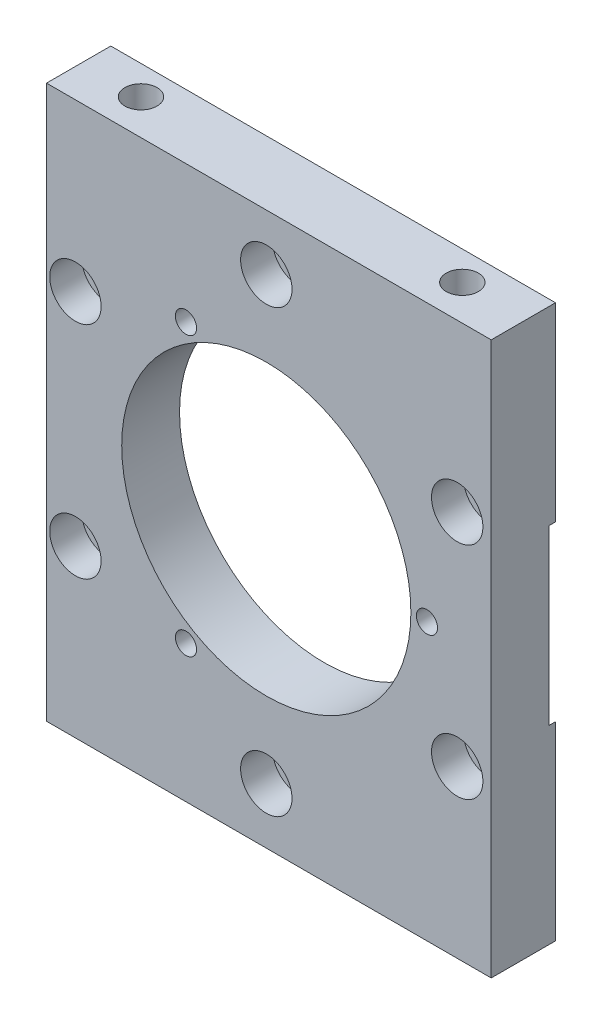
ISO-10303-21;
HEADER;
FILE_DESCRIPTION(('STEP AP214'),'2;1');
FILE_NAME('part.step','',(''),(''),'','','');
FILE_SCHEMA(('AUTOMOTIVE_DESIGN { 1 0 10303 214 1 1 1 1 }'));
ENDSEC;
DATA;
#1=APPLICATION_CONTEXT('core data for automotive mechanical design processes');
#2=APPLICATION_PROTOCOL_DEFINITION('international standard','automotive_design',2000,#1);
#3=PRODUCT_CONTEXT('',#1,'mechanical');
#4=PRODUCT('Part','Part','',(#3));
#5=PRODUCT_RELATED_PRODUCT_CATEGORY('part','',(#4));
#6=PRODUCT_DEFINITION_FORMATION('','',#4);
#7=PRODUCT_DEFINITION_CONTEXT('part definition',#1,'design');
#8=PRODUCT_DEFINITION('design','',#6,#7);
#9=PRODUCT_DEFINITION_SHAPE('','',#8);
#10=(LENGTH_UNIT() NAMED_UNIT(*) SI_UNIT(.MILLI.,.METRE.));
#11=(NAMED_UNIT(*) PLANE_ANGLE_UNIT() SI_UNIT($,.RADIAN.));
#12=(NAMED_UNIT(*) SI_UNIT($,.STERADIAN.) SOLID_ANGLE_UNIT());
#13=UNCERTAINTY_MEASURE_WITH_UNIT(LENGTH_MEASURE(1.E-05),#10,'distance_accuracy_value','');
#14=(GEOMETRIC_REPRESENTATION_CONTEXT(3) GLOBAL_UNCERTAINTY_ASSIGNED_CONTEXT((#13)) GLOBAL_UNIT_ASSIGNED_CONTEXT((#10,
#11,#12)) REPRESENTATION_CONTEXT('',''));
#15=CARTESIAN_POINT('',(0.,0.,0.));
#16=DIRECTION('',(0.,0.,1.));
#17=DIRECTION('',(1.,0.,0.));
#18=AXIS2_PLACEMENT_3D('',#15,#16,#17);
#19=CARTESIAN_POINT('',(-29.7046713498064,-17.1499999999997,5.));
#20=DIRECTION('',(0.,0.,-1.));
#21=DIRECTION('',(-1.,0.,0.));
#22=AXIS2_PLACEMENT_3D('',#19,#20,#21);
#23=CYLINDRICAL_SURFACE('',#22,2.75);
#24=CARTESIAN_POINT('',(-29.7046713498064,-17.1499999999997,0.));
#25=DIRECTION('',(0.,0.,1.));
#26=DIRECTION('',(1.,0.,0.));
#27=AXIS2_PLACEMENT_3D('',#24,#25,#26);
#28=CIRCLE('',#27,2.75);
#29=CARTESIAN_POINT('',(-26.9546713498064,-17.1499999999997,0.));
#30=VERTEX_POINT('',#29);
#31=EDGE_CURVE('E188',#30,#30,#28,.T.);
#32=ORIENTED_EDGE('',*,*,#31,.T.);
#33=EDGE_LOOP('',(#32));
#34=FACE_BOUND('',#33,.T.);
#35=CARTESIAN_POINT('',(-29.7046713498064,-17.1499999999997,-4.));
#36=DIRECTION('',(0.,0.,-1.));
#37=DIRECTION('',(-1.,0.,0.));
#38=AXIS2_PLACEMENT_3D('',#35,#36,#37);
#39=CIRCLE('',#38,2.75);
#40=CARTESIAN_POINT('',(-32.4546713498064,-17.1499999999997,-4.));
#41=VERTEX_POINT('',#40);
#42=EDGE_CURVE('E130',#41,#41,#39,.T.);
#43=ORIENTED_EDGE('',*,*,#42,.T.);
#44=EDGE_LOOP('',(#43));
#45=FACE_BOUND('',#44,.T.);
#46=ADVANCED_FACE('F36',(#34,#45),#23,.F.);
#47=CARTESIAN_POINT('',(0.,-34.2999999999996,5.));
#48=DIRECTION('',(0.,0.,-1.));
#49=DIRECTION('',(-1.,0.,0.));
#50=AXIS2_PLACEMENT_3D('',#47,#48,#49);
#51=CYLINDRICAL_SURFACE('',#50,2.75000000000034);
#52=CARTESIAN_POINT('',(0.,-34.2999999999996,0.));
#53=DIRECTION('',(0.,0.,1.));
#54=DIRECTION('',(1.,0.,0.));
#55=AXIS2_PLACEMENT_3D('',#52,#53,#54);
#56=CIRCLE('',#55,2.75000000000034);
#57=CARTESIAN_POINT('',(2.75000000000034,-34.2999999999996,0.));
#58=VERTEX_POINT('',#57);
#59=EDGE_CURVE('E183',#58,#58,#56,.T.);
#60=ORIENTED_EDGE('',*,*,#59,.T.);
#61=EDGE_LOOP('',(#60));
#62=FACE_BOUND('',#61,.T.);
#63=CARTESIAN_POINT('',(0.,-34.2999999999996,-4.));
#64=DIRECTION('',(0.,0.,-1.));
#65=DIRECTION('',(-1.,0.,0.));
#66=AXIS2_PLACEMENT_3D('',#63,#64,#65);
#67=CIRCLE('',#66,2.75000000000034);
#68=CARTESIAN_POINT('',(-2.75000000000034,-34.2999999999996,-4.));
#69=VERTEX_POINT('',#68);
#70=EDGE_CURVE('E237',#69,#69,#67,.T.);
#71=ORIENTED_EDGE('',*,*,#70,.T.);
#72=EDGE_LOOP('',(#71));
#73=FACE_BOUND('',#72,.T.);
#74=ADVANCED_FACE('F322',(#62,#73),#51,.F.);
#75=CARTESIAN_POINT('',(29.7046713498059,-17.1499999999998,5.));
#76=DIRECTION('',(0.,0.,-1.));
#77=DIRECTION('',(-1.,0.,0.));
#78=AXIS2_PLACEMENT_3D('',#75,#76,#77);
#79=CYLINDRICAL_SURFACE('',#78,2.75000000000026);
#80=CARTESIAN_POINT('',(29.7046713498059,-17.1499999999998,0.));
#81=DIRECTION('',(0.,0.,1.));
#82=DIRECTION('',(1.,0.,0.));
#83=AXIS2_PLACEMENT_3D('',#80,#81,#82);
#84=CIRCLE('',#83,2.75000000000026);
#85=CARTESIAN_POINT('',(32.4546713498062,-17.1499999999998,0.));
#86=VERTEX_POINT('',#85);
#87=EDGE_CURVE('E178',#86,#86,#84,.T.);
#88=ORIENTED_EDGE('',*,*,#87,.T.);
#89=EDGE_LOOP('',(#88));
#90=FACE_BOUND('',#89,.T.);
#91=CARTESIAN_POINT('',(29.7046713498059,-17.1499999999998,-4.));
#92=DIRECTION('',(0.,0.,-1.));
#93=DIRECTION('',(-1.,0.,0.));
#94=AXIS2_PLACEMENT_3D('',#91,#92,#93);
#95=CIRCLE('',#94,2.75000000000026);
#96=CARTESIAN_POINT('',(26.9546713498057,-17.1499999999998,-4.));
#97=VERTEX_POINT('',#96);
#98=EDGE_CURVE('E234',#97,#97,#95,.T.);
#99=ORIENTED_EDGE('',*,*,#98,.T.);
#100=EDGE_LOOP('',(#99));
#101=FACE_BOUND('',#100,.T.);
#102=ADVANCED_FACE('F328',(#90,#101),#79,.F.);
#103=CARTESIAN_POINT('',(29.7046713498059,17.1499999999998,5.));
#104=DIRECTION('',(0.,0.,-1.));
#105=DIRECTION('',(-1.,0.,0.));
#106=AXIS2_PLACEMENT_3D('',#103,#104,#105);
#107=CYLINDRICAL_SURFACE('',#106,2.75000000000018);
#108=CARTESIAN_POINT('',(29.7046713498059,17.1499999999998,0.));
#109=DIRECTION('',(0.,0.,1.));
#110=DIRECTION('',(1.,0.,0.));
#111=AXIS2_PLACEMENT_3D('',#108,#109,#110);
#112=CIRCLE('',#111,2.75000000000018);
#113=CARTESIAN_POINT('',(32.4546713498061,17.1499999999998,0.));
#114=VERTEX_POINT('',#113);
#115=EDGE_CURVE('E173',#114,#114,#112,.T.);
#116=ORIENTED_EDGE('',*,*,#115,.T.);
#117=EDGE_LOOP('',(#116));
#118=FACE_BOUND('',#117,.T.);
#119=CARTESIAN_POINT('',(29.7046713498059,17.1499999999998,-4.));
#120=DIRECTION('',(0.,0.,-1.));
#121=DIRECTION('',(-1.,0.,0.));
#122=AXIS2_PLACEMENT_3D('',#119,#120,#121);
#123=CIRCLE('',#122,2.75000000000018);
#124=CARTESIAN_POINT('',(26.9546713498058,17.1499999999998,-4.));
#125=VERTEX_POINT('',#124);
#126=EDGE_CURVE('E231',#125,#125,#123,.T.);
#127=ORIENTED_EDGE('',*,*,#126,.T.);
#128=EDGE_LOOP('',(#127));
#129=FACE_BOUND('',#128,.T.);
#130=ADVANCED_FACE('F338',(#118,#129),#107,.F.);
#131=CARTESIAN_POINT('',(0.,34.2999999999996,5.));
#132=DIRECTION('',(0.,0.,-1.));
#133=DIRECTION('',(-1.,0.,0.));
#134=AXIS2_PLACEMENT_3D('',#131,#132,#133);
#135=CYLINDRICAL_SURFACE('',#134,2.7500000000001);
#136=CARTESIAN_POINT('',(0.,34.2999999999996,0.));
#137=DIRECTION('',(0.,0.,1.));
#138=DIRECTION('',(1.,0.,0.));
#139=AXIS2_PLACEMENT_3D('',#136,#137,#138);
#140=CIRCLE('',#139,2.7500000000001);
#141=CARTESIAN_POINT('',(2.75000000000011,34.2999999999996,0.));
#142=VERTEX_POINT('',#141);
#143=EDGE_CURVE('E168',#142,#142,#140,.T.);
#144=ORIENTED_EDGE('',*,*,#143,.T.);
#145=EDGE_LOOP('',(#144));
#146=FACE_BOUND('',#145,.T.);
#147=CARTESIAN_POINT('',(0.,34.2999999999996,-4.));
#148=DIRECTION('',(0.,0.,-1.));
#149=DIRECTION('',(-1.,0.,0.));
#150=AXIS2_PLACEMENT_3D('',#147,#148,#149);
#151=CIRCLE('',#150,2.7500000000001);
#152=CARTESIAN_POINT('',(-2.75000000000009,34.2999999999996,-4.));
#153=VERTEX_POINT('',#152);
#154=EDGE_CURVE('E228',#153,#153,#151,.T.);
#155=ORIENTED_EDGE('',*,*,#154,.T.);
#156=EDGE_LOOP('',(#155));
#157=FACE_BOUND('',#156,.T.);
#158=ADVANCED_FACE('F342',(#146,#157),#135,.F.);
#159=CARTESIAN_POINT('',(-29.704671349806,17.1500000000004,5.));
#160=DIRECTION('',(0.,0.,-1.));
#161=DIRECTION('',(-1.,0.,0.));
#162=AXIS2_PLACEMENT_3D('',#159,#160,#161);
#163=CYLINDRICAL_SURFACE('',#162,2.75);
#164=CARTESIAN_POINT('',(-29.704671349806,17.1500000000004,0.));
#165=DIRECTION('',(0.,0.,1.));
#166=DIRECTION('',(1.,0.,0.));
#167=AXIS2_PLACEMENT_3D('',#164,#165,#166);
#168=CIRCLE('',#167,2.75);
#169=CARTESIAN_POINT('',(-26.954671349806,17.1500000000004,0.));
#170=VERTEX_POINT('',#169);
#171=EDGE_CURVE('E164',#170,#170,#168,.T.);
#172=ORIENTED_EDGE('',*,*,#171,.T.);
#173=EDGE_LOOP('',(#172));
#174=FACE_BOUND('',#173,.T.);
#175=CARTESIAN_POINT('',(-29.704671349806,17.1500000000004,-4.));
#176=DIRECTION('',(0.,0.,-1.));
#177=DIRECTION('',(-1.,0.,0.));
#178=AXIS2_PLACEMENT_3D('',#175,#176,#177);
#179=CIRCLE('',#178,2.75);
#180=CARTESIAN_POINT('',(-32.454671349806,17.1500000000004,-4.));
#181=VERTEX_POINT('',#180);
#182=EDGE_CURVE('E225',#181,#181,#179,.T.);
#183=ORIENTED_EDGE('',*,*,#182,.T.);
#184=EDGE_LOOP('',(#183));
#185=FACE_BOUND('',#184,.T.);
#186=ADVANCED_FACE('F333',(#174,#185),#163,.F.);
#187=CARTESIAN_POINT('',(-34.2,-43.,-5.));
#188=DIRECTION('',(0.,0.,1.));
#189=DIRECTION('',(1.,0.,0.));
#190=AXIS2_PLACEMENT_3D('',#187,#188,#189);
#191=PLANE('',#190);
#192=DIRECTION('',(0.,1.,0.));
#193=VECTOR('',#192,1.);
#194=CARTESIAN_POINT('',(35.,43.,-5.));
#195=LINE('',#194,#193);
#196=CARTESIAN_POINT('',(35.,13.4629120178363,-5.));
#197=VERTEX_POINT('',#196);
#198=CARTESIAN_POINT('',(35.,43.,-5.));
#199=VERTEX_POINT('',#198);
#200=EDGE_CURVE('E137',#197,#199,#195,.T.);
#201=ORIENTED_EDGE('',*,*,#200,.F.);
#202=CARTESIAN_POINT('',(0.,0.,-5.));
#203=DIRECTION('',(0.,0.,-1.));
#204=DIRECTION('',(-1.,0.,0.));
#205=AXIS2_PLACEMENT_3D('',#202,#203,#204);
#206=CIRCLE('',#205,37.5);
#207=CARTESIAN_POINT('',(-34.2,15.3821324919531,-5.));
#208=VERTEX_POINT('',#207);
#209=EDGE_CURVE('E125',#208,#197,#206,.T.);
#210=ORIENTED_EDGE('',*,*,#209,.F.);
#211=DIRECTION('',(0.,-1.,0.));
#212=VECTOR('',#211,1.);
#213=CARTESIAN_POINT('',(-34.2,43.,-5.));
#214=LINE('',#213,#212);
#215=CARTESIAN_POINT('',(-34.2,43.,-5.));
#216=VERTEX_POINT('',#215);
#217=EDGE_CURVE('E136',#216,#208,#214,.T.);
#218=ORIENTED_EDGE('',*,*,#217,.F.);
#219=DIRECTION('',(-1.,0.,0.));
#220=VECTOR('',#219,1.);
#221=CARTESIAN_POINT('',(-34.2,43.,-5.));
#222=LINE('',#221,#220);
#223=EDGE_CURVE('E81',#199,#216,#222,.T.);
#224=ORIENTED_EDGE('',*,*,#223,.F.);
#225=EDGE_LOOP('',(#201,#210,#218,#224));
#226=FACE_BOUND('',#225,.T.);
#227=ADVANCED_FACE('F135',(#226),#191,.F.);
#228=CARTESIAN_POINT('',(0.,0.,5.));
#229=DIRECTION('',(0.,0.,-1.));
#230=DIRECTION('',(-1.,0.,0.));
#231=AXIS2_PLACEMENT_3D('',#228,#229,#230);
#232=CYLINDRICAL_SURFACE('',#231,22.5);
#233=CARTESIAN_POINT('',(0.,0.,5.));
#234=DIRECTION('',(0.,0.,1.));
#235=DIRECTION('',(1.,0.,0.));
#236=AXIS2_PLACEMENT_3D('',#233,#234,#235);
#237=CIRCLE('',#236,22.5);
#238=CARTESIAN_POINT('',(22.5,0.,5.));
#239=VERTEX_POINT('',#238);
#240=EDGE_CURVE('E147',#239,#239,#237,.T.);
#241=ORIENTED_EDGE('',*,*,#240,.T.);
#242=EDGE_LOOP('',(#241));
#243=FACE_BOUND('',#242,.T.);
#244=CARTESIAN_POINT('',(0.,0.,-4.));
#245=DIRECTION('',(0.,0.,-1.));
#246=DIRECTION('',(-1.,0.,0.));
#247=AXIS2_PLACEMENT_3D('',#244,#245,#246);
#248=CIRCLE('',#247,22.5);
#249=CARTESIAN_POINT('',(-22.5,0.,-4.));
#250=VERTEX_POINT('',#249);
#251=EDGE_CURVE('E219',#250,#250,#248,.T.);
#252=ORIENTED_EDGE('',*,*,#251,.T.);
#253=EDGE_LOOP('',(#252));
#254=FACE_BOUND('',#253,.T.);
#255=ADVANCED_FACE('F347',(#243,#254),#232,.F.);
#256=CARTESIAN_POINT('',(25.,0.,5.));
#257=DIRECTION('',(0.,0.,1.));
#258=DIRECTION('',(1.,0.,0.));
#259=AXIS2_PLACEMENT_3D('',#256,#257,#258);
#260=CYLINDRICAL_SURFACE('',#259,1.64999999999999);
#261=CARTESIAN_POINT('',(25.,0.,5.));
#262=DIRECTION('',(0.,0.,1.));
#263=DIRECTION('',(1.,0.,0.));
#264=AXIS2_PLACEMENT_3D('',#261,#262,#263);
#265=CIRCLE('',#264,1.64999999999999);
#266=CARTESIAN_POINT('',(26.65,0.,5.));
#267=VERTEX_POINT('',#266);
#268=EDGE_CURVE('E273',#267,#267,#265,.T.);
#269=ORIENTED_EDGE('',*,*,#268,.T.);
#270=EDGE_LOOP('',(#269));
#271=FACE_BOUND('',#270,.T.);
#272=CARTESIAN_POINT('',(25.,0.,-4.));
#273=DIRECTION('',(0.,0.,-1.));
#274=DIRECTION('',(-1.,0.,0.));
#275=AXIS2_PLACEMENT_3D('',#272,#273,#274);
#276=CIRCLE('',#275,1.64999999999999);
#277=CARTESIAN_POINT('',(23.35,0.,-4.));
#278=VERTEX_POINT('',#277);
#279=EDGE_CURVE('E216',#278,#278,#276,.F.);
#280=ORIENTED_EDGE('',*,*,#279,.F.);
#281=EDGE_LOOP('',(#280));
#282=FACE_BOUND('',#281,.T.);
#283=ADVANCED_FACE('F350',(#271,#282),#260,.F.);
#284=CARTESIAN_POINT('',(-12.5000000000001,-21.6506350946109,5.));
#285=DIRECTION('',(0.,0.,1.));
#286=DIRECTION('',(1.,0.,0.));
#287=AXIS2_PLACEMENT_3D('',#284,#285,#286);
#288=CYLINDRICAL_SURFACE('',#287,1.64999999999999);
#289=CARTESIAN_POINT('',(-12.5000000000001,-21.6506350946109,5.));
#290=DIRECTION('',(0.,0.,1.));
#291=DIRECTION('',(1.,0.,0.));
#292=AXIS2_PLACEMENT_3D('',#289,#290,#291);
#293=CIRCLE('',#292,1.64999999999999);
#294=CARTESIAN_POINT('',(-10.8500000000001,-21.6506350946109,5.));
#295=VERTEX_POINT('',#294);
#296=EDGE_CURVE('E270',#295,#295,#293,.T.);
#297=ORIENTED_EDGE('',*,*,#296,.T.);
#298=EDGE_LOOP('',(#297));
#299=FACE_BOUND('',#298,.T.);
#300=CARTESIAN_POINT('',(-12.5000000000001,-21.6506350946109,-4.));
#301=DIRECTION('',(0.,0.,-1.));
#302=DIRECTION('',(-1.,0.,0.));
#303=AXIS2_PLACEMENT_3D('',#300,#301,#302);
#304=CIRCLE('',#303,1.64999999999999);
#305=CARTESIAN_POINT('',(-14.1500000000001,-21.6506350946109,-4.));
#306=VERTEX_POINT('',#305);
#307=EDGE_CURVE('E195',#306,#306,#304,.F.);
#308=ORIENTED_EDGE('',*,*,#307,.F.);
#309=EDGE_LOOP('',(#308));
#310=FACE_BOUND('',#309,.T.);
#311=ADVANCED_FACE('F391',(#299,#310),#288,.F.);
#312=CARTESIAN_POINT('',(-12.5,21.650635094611,5.));
#313=DIRECTION('',(0.,0.,1.));
#314=DIRECTION('',(1.,0.,0.));
#315=AXIS2_PLACEMENT_3D('',#312,#313,#314);
#316=CYLINDRICAL_SURFACE('',#315,1.64999999999999);
#317=CARTESIAN_POINT('',(-12.5,21.650635094611,5.));
#318=DIRECTION('',(0.,0.,1.));
#319=DIRECTION('',(1.,0.,0.));
#320=AXIS2_PLACEMENT_3D('',#317,#318,#319);
#321=CIRCLE('',#320,1.64999999999999);
#322=CARTESIAN_POINT('',(-10.85,21.650635094611,5.));
#323=VERTEX_POINT('',#322);
#324=EDGE_CURVE('E267',#323,#323,#321,.T.);
#325=ORIENTED_EDGE('',*,*,#324,.T.);
#326=EDGE_LOOP('',(#325));
#327=FACE_BOUND('',#326,.T.);
#328=CARTESIAN_POINT('',(-12.5,21.650635094611,-4.));
#329=DIRECTION('',(0.,0.,-1.));
#330=DIRECTION('',(-1.,0.,0.));
#331=AXIS2_PLACEMENT_3D('',#328,#329,#330);
#332=CIRCLE('',#331,1.64999999999999);
#333=CARTESIAN_POINT('',(-14.1499999999999,21.650635094611,-4.));
#334=VERTEX_POINT('',#333);
#335=EDGE_CURVE('E193',#334,#334,#332,.F.);
#336=ORIENTED_EDGE('',*,*,#335,.F.);
#337=EDGE_LOOP('',(#336));
#338=FACE_BOUND('',#337,.T.);
#339=ADVANCED_FACE('F354',(#327,#338),#316,.F.);
#340=CARTESIAN_POINT('',(-34.2,-43.,5.));
#341=DIRECTION('',(0.,0.,1.));
#342=DIRECTION('',(1.,0.,0.));
#343=AXIS2_PLACEMENT_3D('',#340,#341,#342);
#344=PLANE('',#343);
#345=ORIENTED_EDGE('',*,*,#324,.F.);
#346=EDGE_LOOP('',(#345));
#347=FACE_BOUND('',#346,.T.);
#348=ORIENTED_EDGE('',*,*,#296,.F.);
#349=EDGE_LOOP('',(#348));
#350=FACE_BOUND('',#349,.T.);
#351=ORIENTED_EDGE('',*,*,#268,.F.);
#352=EDGE_LOOP('',(#351));
#353=FACE_BOUND('',#352,.T.);
#354=CARTESIAN_POINT('',(-29.7046713498064,-17.1499999999997,5.));
#355=DIRECTION('',(0.,0.,1.));
#356=DIRECTION('',(1.,0.,0.));
#357=AXIS2_PLACEMENT_3D('',#354,#355,#356);
#358=CIRCLE('',#357,4.);
#359=CARTESIAN_POINT('',(-25.7046713498064,-17.1499999999997,5.));
#360=VERTEX_POINT('',#359);
#361=EDGE_CURVE('E276',#360,#360,#358,.T.);
#362=ORIENTED_EDGE('',*,*,#361,.F.);
#363=EDGE_LOOP('',(#362));
#364=FACE_BOUND('',#363,.T.);
#365=CARTESIAN_POINT('',(0.,-34.2999999999996,5.));
#366=DIRECTION('',(0.,0.,1.));
#367=DIRECTION('',(1.,0.,0.));
#368=AXIS2_PLACEMENT_3D('',#365,#366,#367);
#369=CIRCLE('',#368,4.);
#370=CARTESIAN_POINT('',(4.,-34.2999999999996,5.));
#371=VERTEX_POINT('',#370);
#372=EDGE_CURVE('E191',#371,#371,#369,.T.);
#373=ORIENTED_EDGE('',*,*,#372,.F.);
#374=EDGE_LOOP('',(#373));
#375=FACE_BOUND('',#374,.T.);
#376=CARTESIAN_POINT('',(29.7046713498059,-17.1499999999998,5.));
#377=DIRECTION('',(0.,0.,1.));
#378=DIRECTION('',(1.,0.,0.));
#379=AXIS2_PLACEMENT_3D('',#376,#377,#378);
#380=CIRCLE('',#379,4.);
#381=CARTESIAN_POINT('',(33.7046713498059,-17.1499999999998,5.));
#382=VERTEX_POINT('',#381);
#383=EDGE_CURVE('E186',#382,#382,#380,.T.);
#384=ORIENTED_EDGE('',*,*,#383,.F.);
#385=EDGE_LOOP('',(#384));
#386=FACE_BOUND('',#385,.T.);
#387=CARTESIAN_POINT('',(29.7046713498059,17.1499999999998,5.));
#388=DIRECTION('',(0.,0.,1.));
#389=DIRECTION('',(1.,0.,0.));
#390=AXIS2_PLACEMENT_3D('',#387,#388,#389);
#391=CIRCLE('',#390,4.);
#392=CARTESIAN_POINT('',(33.7046713498059,17.1499999999998,5.));
#393=VERTEX_POINT('',#392);
#394=EDGE_CURVE('E181',#393,#393,#391,.T.);
#395=ORIENTED_EDGE('',*,*,#394,.F.);
#396=EDGE_LOOP('',(#395));
#397=FACE_BOUND('',#396,.T.);
#398=CARTESIAN_POINT('',(0.,34.2999999999996,5.));
#399=DIRECTION('',(0.,0.,1.));
#400=DIRECTION('',(1.,0.,0.));
#401=AXIS2_PLACEMENT_3D('',#398,#399,#400);
#402=CIRCLE('',#401,4.);
#403=CARTESIAN_POINT('',(4.00000000000001,34.2999999999996,5.));
#404=VERTEX_POINT('',#403);
#405=EDGE_CURVE('E176',#404,#404,#402,.T.);
#406=ORIENTED_EDGE('',*,*,#405,.F.);
#407=EDGE_LOOP('',(#406));
#408=FACE_BOUND('',#407,.T.);
#409=CARTESIAN_POINT('',(-29.704671349806,17.1500000000004,5.));
#410=DIRECTION('',(0.,0.,1.));
#411=DIRECTION('',(1.,0.,0.));
#412=AXIS2_PLACEMENT_3D('',#409,#410,#411);
#413=CIRCLE('',#412,4.);
#414=CARTESIAN_POINT('',(-25.704671349806,17.1500000000004,5.));
#415=VERTEX_POINT('',#414);
#416=EDGE_CURVE('E171',#415,#415,#413,.T.);
#417=ORIENTED_EDGE('',*,*,#416,.F.);
#418=EDGE_LOOP('',(#417));
#419=FACE_BOUND('',#418,.T.);
#420=DIRECTION('',(0.,-1.,0.));
#421=VECTOR('',#420,1.);
#422=CARTESIAN_POINT('',(-34.2,43.,5.));
#423=LINE('',#422,#421);
#424=CARTESIAN_POINT('',(-34.2,43.,5.));
#425=VERTEX_POINT('',#424);
#426=CARTESIAN_POINT('',(-34.2,-43.,5.));
#427=VERTEX_POINT('',#426);
#428=EDGE_CURVE('E155',#425,#427,#423,.T.);
#429=ORIENTED_EDGE('',*,*,#428,.T.);
#430=DIRECTION('',(1.,0.,0.));
#431=VECTOR('',#430,1.);
#432=CARTESIAN_POINT('',(-34.2,-43.,5.));
#433=LINE('',#432,#431);
#434=CARTESIAN_POINT('',(35.,-43.,5.));
#435=VERTEX_POINT('',#434);
#436=EDGE_CURVE('E89',#427,#435,#433,.T.);
#437=ORIENTED_EDGE('',*,*,#436,.T.);
#438=DIRECTION('',(0.,1.,0.));
#439=VECTOR('',#438,1.);
#440=CARTESIAN_POINT('',(35.,43.,5.));
#441=LINE('',#440,#439);
#442=CARTESIAN_POINT('',(35.,43.,5.));
#443=VERTEX_POINT('',#442);
#444=EDGE_CURVE('E304',#435,#443,#441,.T.);
#445=ORIENTED_EDGE('',*,*,#444,.T.);
#446=DIRECTION('',(-1.,0.,0.));
#447=VECTOR('',#446,1.);
#448=CARTESIAN_POINT('',(-34.2,43.,5.));
#449=LINE('',#448,#447);
#450=EDGE_CURVE('E60',#443,#425,#449,.T.);
#451=ORIENTED_EDGE('',*,*,#450,.T.);
#452=EDGE_LOOP('',(#429,#437,#445,#451));
#453=FACE_BOUND('',#452,.T.);
#454=ORIENTED_EDGE('',*,*,#240,.F.);
#455=EDGE_LOOP('',(#454));
#456=FACE_BOUND('',#455,.T.);
#457=ADVANCED_FACE('F307',(#347,#350,#353,#364,#375,#386,#397,#408,#419,#453,#456),#344,.T.);
#458=CARTESIAN_POINT('',(-34.2,-15.3821324919532,-5.));
#459=VERTEX_POINT('',#458);
#460=CARTESIAN_POINT('',(-34.2,-43.,-5.));
#461=VERTEX_POINT('',#460);
#462=EDGE_CURVE('E144',#459,#461,#214,.T.);
#463=ORIENTED_EDGE('',*,*,#462,.F.);
#464=CARTESIAN_POINT('',(35.,-13.4629120178363,-5.));
#465=VERTEX_POINT('',#464);
#466=EDGE_CURVE('E139',#465,#459,#206,.T.);
#467=ORIENTED_EDGE('',*,*,#466,.F.);
#468=CARTESIAN_POINT('',(35.,-43.,-5.));
#469=VERTEX_POINT('',#468);
#470=EDGE_CURVE('E151',#469,#465,#195,.T.);
#471=ORIENTED_EDGE('',*,*,#470,.F.);
#472=DIRECTION('',(1.,0.,0.));
#473=VECTOR('',#472,1.);
#474=CARTESIAN_POINT('',(-34.2,-43.,-5.));
#475=LINE('',#474,#473);
#476=EDGE_CURVE('E143',#461,#469,#475,.T.);
#477=ORIENTED_EDGE('',*,*,#476,.F.);
#478=EDGE_LOOP('',(#463,#467,#471,#477));
#479=FACE_BOUND('',#478,.T.);
#480=ADVANCED_FACE('F210',(#479),#191,.F.);
#481=CARTESIAN_POINT('',(-34.2,43.,5.));
#482=DIRECTION('',(1.,0.,0.));
#483=DIRECTION('',(0.,1.,0.));
#484=AXIS2_PLACEMENT_3D('',#481,#482,#483);
#485=PLANE('',#484);
#486=DIRECTION('',(0.,1.,0.));
#487=VECTOR('',#486,1.);
#488=CARTESIAN_POINT('',(-34.2,43.,-4.));
#489=LINE('',#488,#487);
#490=CARTESIAN_POINT('',(-34.2,-15.3821324919532,-4.));
#491=VERTEX_POINT('',#490);
#492=CARTESIAN_POINT('',(-34.2,15.3821324919531,-4.));
#493=VERTEX_POINT('',#492);
#494=EDGE_CURVE('E223',#491,#493,#489,.T.);
#495=ORIENTED_EDGE('',*,*,#494,.F.);
#496=DIRECTION('',(0.,0.,-1.));
#497=VECTOR('',#496,1.);
#498=CARTESIAN_POINT('',(-34.2,-15.3821324919532,-4.));
#499=LINE('',#498,#497);
#500=EDGE_CURVE('E129',#491,#459,#499,.T.);
#501=ORIENTED_EDGE('',*,*,#500,.T.);
#502=ORIENTED_EDGE('',*,*,#462,.T.);
#503=DIRECTION('',(0.,0.,-1.));
#504=VECTOR('',#503,1.);
#505=CARTESIAN_POINT('',(-34.2,-43.,5.));
#506=LINE('',#505,#504);
#507=EDGE_CURVE('E162',#427,#461,#506,.T.);
#508=ORIENTED_EDGE('',*,*,#507,.F.);
#509=ORIENTED_EDGE('',*,*,#428,.F.);
#510=DIRECTION('',(0.,0.,-1.));
#511=VECTOR('',#510,1.);
#512=CARTESIAN_POINT('',(-34.2,43.,5.));
#513=LINE('',#512,#511);
#514=EDGE_CURVE('E142',#425,#216,#513,.T.);
#515=ORIENTED_EDGE('',*,*,#514,.T.);
#516=ORIENTED_EDGE('',*,*,#217,.T.);
#517=DIRECTION('',(0.,0.,-1.));
#518=VECTOR('',#517,1.);
#519=CARTESIAN_POINT('',(-34.2,15.3821324919531,-4.));
#520=LINE('',#519,#518);
#521=EDGE_CURVE('E122',#208,#493,#520,.F.);
#522=ORIENTED_EDGE('',*,*,#521,.T.);
#523=EDGE_LOOP('',(#495,#501,#502,#508,#509,#515,#516,#522));
#524=FACE_BOUND('',#523,.T.);
#525=ADVANCED_FACE('F38',(#524),#485,.F.);
#526=CARTESIAN_POINT('',(-34.2,-43.,5.));
#527=DIRECTION('',(0.,1.,0.));
#528=DIRECTION('',(0.,0.,1.));
#529=AXIS2_PLACEMENT_3D('',#526,#527,#528);
#530=PLANE('',#529);
#531=CARTESIAN_POINT('',(-25.,-43.,-0.5));
#532=DIRECTION('',(0.,-1.,0.));
#533=DIRECTION('',(0.,0.,-1.));
#534=AXIS2_PLACEMENT_3D('',#531,#532,#533);
#535=CIRCLE('',#534,2.49999999999999);
#536=CARTESIAN_POINT('',(-25.,-43.,-2.99999999999999));
#537=VERTEX_POINT('',#536);
#538=EDGE_CURVE('E243',#537,#537,#535,.T.);
#539=ORIENTED_EDGE('',*,*,#538,.F.);
#540=EDGE_LOOP('',(#539));
#541=FACE_BOUND('',#540,.T.);
#542=CARTESIAN_POINT('',(25.,-43.,-0.5));
#543=DIRECTION('',(0.,-1.,0.));
#544=DIRECTION('',(0.,0.,-1.));
#545=AXIS2_PLACEMENT_3D('',#542,#543,#544);
#546=CIRCLE('',#545,2.49999999999999);
#547=CARTESIAN_POINT('',(25.,-43.,-2.99999999999999));
#548=VERTEX_POINT('',#547);
#549=EDGE_CURVE('E249',#548,#548,#546,.T.);
#550=ORIENTED_EDGE('',*,*,#549,.F.);
#551=EDGE_LOOP('',(#550));
#552=FACE_BOUND('',#551,.T.);
#553=ORIENTED_EDGE('',*,*,#476,.T.);
#554=DIRECTION('',(0.,0.,-1.));
#555=VECTOR('',#554,1.);
#556=CARTESIAN_POINT('',(35.,-43.,5.));
#557=LINE('',#556,#555);
#558=EDGE_CURVE('E159',#435,#469,#557,.T.);
#559=ORIENTED_EDGE('',*,*,#558,.F.);
#560=ORIENTED_EDGE('',*,*,#436,.F.);
#561=ORIENTED_EDGE('',*,*,#507,.T.);
#562=EDGE_LOOP('',(#553,#559,#560,#561));
#563=FACE_BOUND('',#562,.T.);
#564=ADVANCED_FACE('F311',(#541,#552,#563),#530,.F.);
#565=CARTESIAN_POINT('',(35.,43.,5.));
#566=DIRECTION('',(-1.,0.,0.));
#567=DIRECTION('',(0.,0.,1.));
#568=AXIS2_PLACEMENT_3D('',#565,#566,#567);
#569=PLANE('',#568);
#570=DIRECTION('',(0.,-1.,0.));
#571=VECTOR('',#570,1.);
#572=CARTESIAN_POINT('',(35.,43.,-4.));
#573=LINE('',#572,#571);
#574=CARTESIAN_POINT('',(35.,13.4629120178363,-4.));
#575=VERTEX_POINT('',#574);
#576=CARTESIAN_POINT('',(35.,-13.4629120178363,-4.));
#577=VERTEX_POINT('',#576);
#578=EDGE_CURVE('E200',#575,#577,#573,.T.);
#579=ORIENTED_EDGE('',*,*,#578,.F.);
#580=DIRECTION('',(0.,0.,-1.));
#581=VECTOR('',#580,1.);
#582=CARTESIAN_POINT('',(35.,13.4629120178363,-4.));
#583=LINE('',#582,#581);
#584=EDGE_CURVE('E11',#575,#197,#583,.T.);
#585=ORIENTED_EDGE('',*,*,#584,.T.);
#586=ORIENTED_EDGE('',*,*,#200,.T.);
#587=DIRECTION('',(0.,0.,-1.));
#588=VECTOR('',#587,1.);
#589=CARTESIAN_POINT('',(35.,43.,5.));
#590=LINE('',#589,#588);
#591=EDGE_CURVE('E157',#443,#199,#590,.T.);
#592=ORIENTED_EDGE('',*,*,#591,.F.);
#593=ORIENTED_EDGE('',*,*,#444,.F.);
#594=ORIENTED_EDGE('',*,*,#558,.T.);
#595=ORIENTED_EDGE('',*,*,#470,.T.);
#596=DIRECTION('',(0.,0.,-1.));
#597=VECTOR('',#596,1.);
#598=CARTESIAN_POINT('',(35.,-13.4629120178363,-4.));
#599=LINE('',#598,#597);
#600=EDGE_CURVE('E44',#465,#577,#599,.F.);
#601=ORIENTED_EDGE('',*,*,#600,.T.);
#602=EDGE_LOOP('',(#579,#585,#586,#592,#593,#594,#595,#601));
#603=FACE_BOUND('',#602,.T.);
#604=ADVANCED_FACE('F199',(#603),#569,.F.);
#605=CARTESIAN_POINT('',(-34.2,43.,5.));
#606=DIRECTION('',(0.,-1.,0.));
#607=DIRECTION('',(0.,0.,-1.));
#608=AXIS2_PLACEMENT_3D('',#605,#606,#607);
#609=PLANE('',#608);
#610=CARTESIAN_POINT('',(-25.,43.,-0.5));
#611=DIRECTION('',(0.,1.,0.));
#612=DIRECTION('',(0.,0.,1.));
#613=AXIS2_PLACEMENT_3D('',#610,#611,#612);
#614=CIRCLE('',#613,2.5);
#615=CARTESIAN_POINT('',(-25.,43.,2.));
#616=VERTEX_POINT('',#615);
#617=EDGE_CURVE('E255',#616,#616,#614,.T.);
#618=ORIENTED_EDGE('',*,*,#617,.F.);
#619=EDGE_LOOP('',(#618));
#620=FACE_BOUND('',#619,.T.);
#621=CARTESIAN_POINT('',(25.,43.,-0.5));
#622=DIRECTION('',(0.,1.,0.));
#623=DIRECTION('',(0.,0.,1.));
#624=AXIS2_PLACEMENT_3D('',#621,#622,#623);
#625=CIRCLE('',#624,2.5);
#626=CARTESIAN_POINT('',(25.,43.,2.));
#627=VERTEX_POINT('',#626);
#628=EDGE_CURVE('E261',#627,#627,#625,.T.);
#629=ORIENTED_EDGE('',*,*,#628,.F.);
#630=EDGE_LOOP('',(#629));
#631=FACE_BOUND('',#630,.T.);
#632=ORIENTED_EDGE('',*,*,#223,.T.);
#633=ORIENTED_EDGE('',*,*,#514,.F.);
#634=ORIENTED_EDGE('',*,*,#450,.F.);
#635=ORIENTED_EDGE('',*,*,#591,.T.);
#636=EDGE_LOOP('',(#632,#633,#634,#635));
#637=FACE_BOUND('',#636,.T.);
#638=ADVANCED_FACE('F309',(#620,#631,#637),#609,.F.);
#639=CARTESIAN_POINT('',(-29.704671349806,17.1500000000004,0.));
#640=DIRECTION('',(0.,0.,1.));
#641=DIRECTION('',(1.,0.,0.));
#642=AXIS2_PLACEMENT_3D('',#639,#640,#641);
#643=CYLINDRICAL_SURFACE('',#642,4.);
#644=CARTESIAN_POINT('',(-29.704671349806,17.1500000000004,0.));
#645=DIRECTION('',(0.,0.,1.));
#646=DIRECTION('',(1.,0.,0.));
#647=AXIS2_PLACEMENT_3D('',#644,#645,#646);
#648=CIRCLE('',#647,4.);
#649=CARTESIAN_POINT('',(-25.704671349806,17.1500000000004,0.));
#650=VERTEX_POINT('',#649);
#651=EDGE_CURVE('E167',#650,#650,#648,.T.);
#652=ORIENTED_EDGE('',*,*,#651,.F.);
#653=EDGE_LOOP('',(#652));
#654=FACE_BOUND('',#653,.T.);
#655=ORIENTED_EDGE('',*,*,#416,.T.);
#656=EDGE_LOOP('',(#655));
#657=FACE_BOUND('',#656,.T.);
#658=ADVANCED_FACE('F359',(#654,#657),#643,.F.);
#659=CARTESIAN_POINT('',(-29.704671349806,17.1500000000004,0.));
#660=DIRECTION('',(0.,0.,1.));
#661=DIRECTION('',(1.,0.,0.));
#662=AXIS2_PLACEMENT_3D('',#659,#660,#661);
#663=PLANE('',#662);
#664=ORIENTED_EDGE('',*,*,#171,.F.);
#665=EDGE_LOOP('',(#664));
#666=FACE_BOUND('',#665,.T.);
#667=ORIENTED_EDGE('',*,*,#651,.T.);
#668=EDGE_LOOP('',(#667));
#669=FACE_BOUND('',#668,.T.);
#670=ADVANCED_FACE('F364',(#666,#669),#663,.T.);
#671=CARTESIAN_POINT('',(0.,34.2999999999996,0.));
#672=DIRECTION('',(0.,0.,1.));
#673=DIRECTION('',(1.,0.,0.));
#674=AXIS2_PLACEMENT_3D('',#671,#672,#673);
#675=CYLINDRICAL_SURFACE('',#674,4.);
#676=CARTESIAN_POINT('',(0.,34.2999999999996,0.));
#677=DIRECTION('',(0.,0.,1.));
#678=DIRECTION('',(1.,0.,0.));
#679=AXIS2_PLACEMENT_3D('',#676,#677,#678);
#680=CIRCLE('',#679,4.);
#681=CARTESIAN_POINT('',(4.00000000000001,34.2999999999996,0.));
#682=VERTEX_POINT('',#681);
#683=EDGE_CURVE('E172',#682,#682,#680,.T.);
#684=ORIENTED_EDGE('',*,*,#683,.F.);
#685=EDGE_LOOP('',(#684));
#686=FACE_BOUND('',#685,.T.);
#687=ORIENTED_EDGE('',*,*,#405,.T.);
#688=EDGE_LOOP('',(#687));
#689=FACE_BOUND('',#688,.T.);
#690=ADVANCED_FACE('F433',(#686,#689),#675,.F.);
#691=CARTESIAN_POINT('',(0.,34.2999999999996,0.));
#692=DIRECTION('',(0.,0.,1.));
#693=DIRECTION('',(1.,0.,0.));
#694=AXIS2_PLACEMENT_3D('',#691,#692,#693);
#695=PLANE('',#694);
#696=ORIENTED_EDGE('',*,*,#143,.F.);
#697=EDGE_LOOP('',(#696));
#698=FACE_BOUND('',#697,.T.);
#699=ORIENTED_EDGE('',*,*,#683,.T.);
#700=EDGE_LOOP('',(#699));
#701=FACE_BOUND('',#700,.T.);
#702=ADVANCED_FACE('F429',(#698,#701),#695,.T.);
#703=CARTESIAN_POINT('',(29.7046713498059,17.1499999999998,0.));
#704=DIRECTION('',(0.,0.,1.));
#705=DIRECTION('',(1.,0.,0.));
#706=AXIS2_PLACEMENT_3D('',#703,#704,#705);
#707=CYLINDRICAL_SURFACE('',#706,4.);
#708=CARTESIAN_POINT('',(29.7046713498059,17.1499999999998,0.));
#709=DIRECTION('',(0.,0.,1.));
#710=DIRECTION('',(1.,0.,0.));
#711=AXIS2_PLACEMENT_3D('',#708,#709,#710);
#712=CIRCLE('',#711,4.);
#713=CARTESIAN_POINT('',(33.7046713498059,17.1499999999998,0.));
#714=VERTEX_POINT('',#713);
#715=EDGE_CURVE('E177',#714,#714,#712,.T.);
#716=ORIENTED_EDGE('',*,*,#715,.F.);
#717=EDGE_LOOP('',(#716));
#718=FACE_BOUND('',#717,.T.);
#719=ORIENTED_EDGE('',*,*,#394,.T.);
#720=EDGE_LOOP('',(#719));
#721=FACE_BOUND('',#720,.T.);
#722=ADVANCED_FACE('F425',(#718,#721),#707,.F.);
#723=CARTESIAN_POINT('',(29.7046713498059,17.1499999999998,0.));
#724=DIRECTION('',(0.,0.,1.));
#725=DIRECTION('',(1.,0.,0.));
#726=AXIS2_PLACEMENT_3D('',#723,#724,#725);
#727=PLANE('',#726);
#728=ORIENTED_EDGE('',*,*,#115,.F.);
#729=EDGE_LOOP('',(#728));
#730=FACE_BOUND('',#729,.T.);
#731=ORIENTED_EDGE('',*,*,#715,.T.);
#732=EDGE_LOOP('',(#731));
#733=FACE_BOUND('',#732,.T.);
#734=ADVANCED_FACE('F421',(#730,#733),#727,.T.);
#735=CARTESIAN_POINT('',(29.7046713498059,-17.1499999999998,0.));
#736=DIRECTION('',(0.,0.,1.));
#737=DIRECTION('',(1.,0.,0.));
#738=AXIS2_PLACEMENT_3D('',#735,#736,#737);
#739=CYLINDRICAL_SURFACE('',#738,4.);
#740=CARTESIAN_POINT('',(29.7046713498059,-17.1499999999998,0.));
#741=DIRECTION('',(0.,0.,1.));
#742=DIRECTION('',(1.,0.,0.));
#743=AXIS2_PLACEMENT_3D('',#740,#741,#742);
#744=CIRCLE('',#743,4.);
#745=CARTESIAN_POINT('',(33.7046713498059,-17.1499999999998,0.));
#746=VERTEX_POINT('',#745);
#747=EDGE_CURVE('E182',#746,#746,#744,.T.);
#748=ORIENTED_EDGE('',*,*,#747,.F.);
#749=EDGE_LOOP('',(#748));
#750=FACE_BOUND('',#749,.T.);
#751=ORIENTED_EDGE('',*,*,#383,.T.);
#752=EDGE_LOOP('',(#751));
#753=FACE_BOUND('',#752,.T.);
#754=ADVANCED_FACE('F417',(#750,#753),#739,.F.);
#755=CARTESIAN_POINT('',(29.7046713498059,-17.1499999999998,0.));
#756=DIRECTION('',(0.,0.,1.));
#757=DIRECTION('',(1.,0.,0.));
#758=AXIS2_PLACEMENT_3D('',#755,#756,#757);
#759=PLANE('',#758);
#760=ORIENTED_EDGE('',*,*,#87,.F.);
#761=EDGE_LOOP('',(#760));
#762=FACE_BOUND('',#761,.T.);
#763=ORIENTED_EDGE('',*,*,#747,.T.);
#764=EDGE_LOOP('',(#763));
#765=FACE_BOUND('',#764,.T.);
#766=ADVANCED_FACE('F413',(#762,#765),#759,.T.);
#767=CARTESIAN_POINT('',(0.,-34.2999999999996,0.));
#768=DIRECTION('',(0.,0.,1.));
#769=DIRECTION('',(1.,0.,0.));
#770=AXIS2_PLACEMENT_3D('',#767,#768,#769);
#771=CYLINDRICAL_SURFACE('',#770,4.);
#772=CARTESIAN_POINT('',(0.,-34.2999999999996,0.));
#773=DIRECTION('',(0.,0.,1.));
#774=DIRECTION('',(1.,0.,0.));
#775=AXIS2_PLACEMENT_3D('',#772,#773,#774);
#776=CIRCLE('',#775,4.);
#777=CARTESIAN_POINT('',(4.,-34.2999999999996,0.));
#778=VERTEX_POINT('',#777);
#779=EDGE_CURVE('E187',#778,#778,#776,.T.);
#780=ORIENTED_EDGE('',*,*,#779,.F.);
#781=EDGE_LOOP('',(#780));
#782=FACE_BOUND('',#781,.T.);
#783=ORIENTED_EDGE('',*,*,#372,.T.);
#784=EDGE_LOOP('',(#783));
#785=FACE_BOUND('',#784,.T.);
#786=ADVANCED_FACE('F409',(#782,#785),#771,.F.);
#787=CARTESIAN_POINT('',(0.,-34.2999999999996,0.));
#788=DIRECTION('',(0.,0.,1.));
#789=DIRECTION('',(1.,0.,0.));
#790=AXIS2_PLACEMENT_3D('',#787,#788,#789);
#791=PLANE('',#790);
#792=ORIENTED_EDGE('',*,*,#59,.F.);
#793=EDGE_LOOP('',(#792));
#794=FACE_BOUND('',#793,.T.);
#795=ORIENTED_EDGE('',*,*,#779,.T.);
#796=EDGE_LOOP('',(#795));
#797=FACE_BOUND('',#796,.T.);
#798=ADVANCED_FACE('F405',(#794,#797),#791,.T.);
#799=CARTESIAN_POINT('',(-29.7046713498064,-17.1499999999997,0.));
#800=DIRECTION('',(0.,0.,1.));
#801=DIRECTION('',(1.,0.,0.));
#802=AXIS2_PLACEMENT_3D('',#799,#800,#801);
#803=CYLINDRICAL_SURFACE('',#802,4.);
#804=CARTESIAN_POINT('',(-29.7046713498064,-17.1499999999997,0.));
#805=DIRECTION('',(0.,0.,1.));
#806=DIRECTION('',(1.,0.,0.));
#807=AXIS2_PLACEMENT_3D('',#804,#805,#806);
#808=CIRCLE('',#807,4.);
#809=CARTESIAN_POINT('',(-25.7046713498064,-17.1499999999997,0.));
#810=VERTEX_POINT('',#809);
#811=EDGE_CURVE('E192',#810,#810,#808,.T.);
#812=ORIENTED_EDGE('',*,*,#811,.F.);
#813=EDGE_LOOP('',(#812));
#814=FACE_BOUND('',#813,.T.);
#815=ORIENTED_EDGE('',*,*,#361,.T.);
#816=EDGE_LOOP('',(#815));
#817=FACE_BOUND('',#816,.T.);
#818=ADVANCED_FACE('F401',(#814,#817),#803,.F.);
#819=CARTESIAN_POINT('',(-29.7046713498064,-17.1499999999997,0.));
#820=DIRECTION('',(0.,0.,1.));
#821=DIRECTION('',(1.,0.,0.));
#822=AXIS2_PLACEMENT_3D('',#819,#820,#821);
#823=PLANE('',#822);
#824=ORIENTED_EDGE('',*,*,#31,.F.);
#825=EDGE_LOOP('',(#824));
#826=FACE_BOUND('',#825,.T.);
#827=ORIENTED_EDGE('',*,*,#811,.T.);
#828=EDGE_LOOP('',(#827));
#829=FACE_BOUND('',#828,.T.);
#830=ADVANCED_FACE('F383',(#826,#829),#823,.T.);
#831=CARTESIAN_POINT('',(25.,25.,-0.5));
#832=DIRECTION('',(0.,1.,0.));
#833=DIRECTION('',(0.,0.,1.));
#834=AXIS2_PLACEMENT_3D('',#831,#832,#833);
#835=CONICAL_SURFACE('',#834,2.5,1.02974425867665);
#836=CARTESIAN_POINT('',(25.,23.4978484524311,-0.5));
#837=VERTEX_POINT('',#836);
#838=VERTEX_LOOP('',#837);
#839=FACE_BOUND('',#838,.T.);
#840=CARTESIAN_POINT('',(25.,25.,-0.5));
#841=DIRECTION('',(0.,1.,0.));
#842=DIRECTION('',(0.,0.,1.));
#843=AXIS2_PLACEMENT_3D('',#840,#841,#842);
#844=CIRCLE('',#843,2.5);
#845=CARTESIAN_POINT('',(25.,25.,1.99999999999999));
#846=VERTEX_POINT('',#845);
#847=EDGE_CURVE('E264',#846,#846,#844,.T.);
#848=ORIENTED_EDGE('',*,*,#847,.T.);
#849=EDGE_LOOP('',(#848));
#850=FACE_BOUND('',#849,.T.);
#851=ADVANCED_FACE('F373',(#839,#850),#835,.F.);
#852=CARTESIAN_POINT('',(25.,43.,-0.5));
#853=DIRECTION('',(0.,1.,0.));
#854=DIRECTION('',(0.,0.,1.));
#855=AXIS2_PLACEMENT_3D('',#852,#853,#854);
#856=CYLINDRICAL_SURFACE('',#855,2.5);
#857=ORIENTED_EDGE('',*,*,#847,.F.);
#858=EDGE_LOOP('',(#857));
#859=FACE_BOUND('',#858,.T.);
#860=ORIENTED_EDGE('',*,*,#628,.T.);
#861=EDGE_LOOP('',(#860));
#862=FACE_BOUND('',#861,.T.);
#863=ADVANCED_FACE('F370',(#859,#862),#856,.F.);
#864=CARTESIAN_POINT('',(-25.,25.,-0.5));
#865=DIRECTION('',(0.,1.,0.));
#866=DIRECTION('',(0.,0.,1.));
#867=AXIS2_PLACEMENT_3D('',#864,#865,#866);
#868=CONICAL_SURFACE('',#867,2.5,1.02974425867665);
#869=CARTESIAN_POINT('',(-25.,23.4978484524311,-0.5));
#870=VERTEX_POINT('',#869);
#871=VERTEX_LOOP('',#870);
#872=FACE_BOUND('',#871,.T.);
#873=CARTESIAN_POINT('',(-25.,25.,-0.5));
#874=DIRECTION('',(0.,1.,0.));
#875=DIRECTION('',(0.,0.,1.));
#876=AXIS2_PLACEMENT_3D('',#873,#874,#875);
#877=CIRCLE('',#876,2.5);
#878=CARTESIAN_POINT('',(-25.,25.,1.99999999999999));
#879=VERTEX_POINT('',#878);
#880=EDGE_CURVE('E258',#879,#879,#877,.T.);
#881=ORIENTED_EDGE('',*,*,#880,.T.);
#882=EDGE_LOOP('',(#881));
#883=FACE_BOUND('',#882,.T.);
#884=ADVANCED_FACE('F372',(#872,#883),#868,.F.);
#885=CARTESIAN_POINT('',(-25.,43.,-0.5));
#886=DIRECTION('',(0.,1.,0.));
#887=DIRECTION('',(0.,0.,1.));
#888=AXIS2_PLACEMENT_3D('',#885,#886,#887);
#889=CYLINDRICAL_SURFACE('',#888,2.5);
#890=ORIENTED_EDGE('',*,*,#880,.F.);
#891=EDGE_LOOP('',(#890));
#892=FACE_BOUND('',#891,.T.);
#893=ORIENTED_EDGE('',*,*,#617,.T.);
#894=EDGE_LOOP('',(#893));
#895=FACE_BOUND('',#894,.T.);
#896=ADVANCED_FACE('F380',(#892,#895),#889,.F.);
#897=CARTESIAN_POINT('',(25.,-25.,-0.5));
#898=DIRECTION('',(0.,-1.,0.));
#899=DIRECTION('',(0.,0.,-1.));
#900=AXIS2_PLACEMENT_3D('',#897,#898,#899);
#901=CONICAL_SURFACE('',#900,2.49999999999999,1.02974425867665);
#902=CARTESIAN_POINT('',(25.,-23.4978484524311,-0.5));
#903=VERTEX_POINT('',#902);
#904=VERTEX_LOOP('',#903);
#905=FACE_BOUND('',#904,.T.);
#906=CARTESIAN_POINT('',(25.,-25.,-0.5));
#907=DIRECTION('',(0.,-1.,0.));
#908=DIRECTION('',(0.,0.,-1.));
#909=AXIS2_PLACEMENT_3D('',#906,#907,#908);
#910=CIRCLE('',#909,2.49999999999999);
#911=CARTESIAN_POINT('',(25.,-25.,-2.99999999999999));
#912=VERTEX_POINT('',#911);
#913=EDGE_CURVE('E252',#912,#912,#910,.T.);
#914=ORIENTED_EDGE('',*,*,#913,.T.);
#915=EDGE_LOOP('',(#914));
#916=FACE_BOUND('',#915,.T.);
#917=ADVANCED_FACE('F488',(#905,#916),#901,.F.);
#918=CARTESIAN_POINT('',(25.,-43.,-0.5));
#919=DIRECTION('',(0.,-1.,0.));
#920=DIRECTION('',(0.,0.,-1.));
#921=AXIS2_PLACEMENT_3D('',#918,#919,#920);
#922=CYLINDRICAL_SURFACE('',#921,2.49999999999999);
#923=ORIENTED_EDGE('',*,*,#913,.F.);
#924=EDGE_LOOP('',(#923));
#925=FACE_BOUND('',#924,.T.);
#926=ORIENTED_EDGE('',*,*,#549,.T.);
#927=EDGE_LOOP('',(#926));
#928=FACE_BOUND('',#927,.T.);
#929=ADVANCED_FACE('F484',(#925,#928),#922,.F.);
#930=CARTESIAN_POINT('',(-25.,-25.,-0.5));
#931=DIRECTION('',(0.,-1.,0.));
#932=DIRECTION('',(0.,0.,-1.));
#933=AXIS2_PLACEMENT_3D('',#930,#931,#932);
#934=CONICAL_SURFACE('',#933,2.49999999999999,1.02974425867665);
#935=CARTESIAN_POINT('',(-25.,-23.4978484524311,-0.5));
#936=VERTEX_POINT('',#935);
#937=VERTEX_LOOP('',#936);
#938=FACE_BOUND('',#937,.T.);
#939=CARTESIAN_POINT('',(-25.,-25.,-0.5));
#940=DIRECTION('',(0.,-1.,0.));
#941=DIRECTION('',(0.,0.,-1.));
#942=AXIS2_PLACEMENT_3D('',#939,#940,#941);
#943=CIRCLE('',#942,2.49999999999999);
#944=CARTESIAN_POINT('',(-25.,-25.,-2.99999999999999));
#945=VERTEX_POINT('',#944);
#946=EDGE_CURVE('E246',#945,#945,#943,.T.);
#947=ORIENTED_EDGE('',*,*,#946,.T.);
#948=EDGE_LOOP('',(#947));
#949=FACE_BOUND('',#948,.T.);
#950=ADVANCED_FACE('F480',(#938,#949),#934,.F.);
#951=CARTESIAN_POINT('',(-25.,-43.,-0.5));
#952=DIRECTION('',(0.,-1.,0.));
#953=DIRECTION('',(0.,0.,-1.));
#954=AXIS2_PLACEMENT_3D('',#951,#952,#953);
#955=CYLINDRICAL_SURFACE('',#954,2.49999999999999);
#956=ORIENTED_EDGE('',*,*,#946,.F.);
#957=EDGE_LOOP('',(#956));
#958=FACE_BOUND('',#957,.T.);
#959=ORIENTED_EDGE('',*,*,#538,.T.);
#960=EDGE_LOOP('',(#959));
#961=FACE_BOUND('',#960,.T.);
#962=ADVANCED_FACE('F477',(#958,#961),#955,.F.);
#963=CARTESIAN_POINT('',(0.,0.,-4.));
#964=DIRECTION('',(0.,0.,-1.));
#965=DIRECTION('',(-1.,0.,0.));
#966=AXIS2_PLACEMENT_3D('',#963,#964,#965);
#967=CYLINDRICAL_SURFACE('',#966,37.5);
#968=CARTESIAN_POINT('',(0.,0.,-4.));
#969=DIRECTION('',(0.,0.,-1.));
#970=DIRECTION('',(-1.,0.,0.));
#971=AXIS2_PLACEMENT_3D('',#968,#969,#970);
#972=CIRCLE('',#971,37.5);
#973=EDGE_CURVE('E138',#577,#491,#972,.T.);
#974=ORIENTED_EDGE('',*,*,#973,.F.);
#975=ORIENTED_EDGE('',*,*,#600,.F.);
#976=ORIENTED_EDGE('',*,*,#466,.T.);
#977=ORIENTED_EDGE('',*,*,#500,.F.);
#978=EDGE_LOOP('',(#974,#975,#976,#977));
#979=FACE_BOUND('',#978,.T.);
#980=ADVANCED_FACE('F205',(#979),#967,.F.);
#981=ORIENTED_EDGE('',*,*,#209,.T.);
#982=ORIENTED_EDGE('',*,*,#584,.F.);
#983=EDGE_CURVE('E51',#493,#575,#972,.T.);
#984=ORIENTED_EDGE('',*,*,#983,.F.);
#985=ORIENTED_EDGE('',*,*,#521,.F.);
#986=EDGE_LOOP('',(#981,#982,#984,#985));
#987=FACE_BOUND('',#986,.T.);
#988=ADVANCED_FACE('F124',(#987),#967,.F.);
#989=CARTESIAN_POINT('',(0.,0.,-4.));
#990=DIRECTION('',(0.,0.,-1.));
#991=DIRECTION('',(-1.,0.,0.));
#992=AXIS2_PLACEMENT_3D('',#989,#990,#991);
#993=PLANE('',#992);
#994=ORIENTED_EDGE('',*,*,#42,.F.);
#995=EDGE_LOOP('',(#994));
#996=FACE_BOUND('',#995,.T.);
#997=ORIENTED_EDGE('',*,*,#70,.F.);
#998=EDGE_LOOP('',(#997));
#999=FACE_BOUND('',#998,.T.);
#1000=ORIENTED_EDGE('',*,*,#98,.F.);
#1001=EDGE_LOOP('',(#1000));
#1002=FACE_BOUND('',#1001,.T.);
#1003=ORIENTED_EDGE('',*,*,#126,.F.);
#1004=EDGE_LOOP('',(#1003));
#1005=FACE_BOUND('',#1004,.T.);
#1006=ORIENTED_EDGE('',*,*,#154,.F.);
#1007=EDGE_LOOP('',(#1006));
#1008=FACE_BOUND('',#1007,.T.);
#1009=ORIENTED_EDGE('',*,*,#182,.F.);
#1010=EDGE_LOOP('',(#1009));
#1011=FACE_BOUND('',#1010,.T.);
#1012=ORIENTED_EDGE('',*,*,#251,.F.);
#1013=EDGE_LOOP('',(#1012));
#1014=FACE_BOUND('',#1013,.T.);
#1015=ORIENTED_EDGE('',*,*,#307,.T.);
#1016=EDGE_LOOP('',(#1015));
#1017=FACE_BOUND('',#1016,.T.);
#1018=ORIENTED_EDGE('',*,*,#335,.T.);
#1019=EDGE_LOOP('',(#1018));
#1020=FACE_BOUND('',#1019,.T.);
#1021=ORIENTED_EDGE('',*,*,#279,.T.);
#1022=EDGE_LOOP('',(#1021));
#1023=FACE_BOUND('',#1022,.T.);
#1024=ORIENTED_EDGE('',*,*,#494,.T.);
#1025=ORIENTED_EDGE('',*,*,#983,.T.);
#1026=ORIENTED_EDGE('',*,*,#578,.T.);
#1027=ORIENTED_EDGE('',*,*,#973,.T.);
#1028=EDGE_LOOP('',(#1024,#1025,#1026,#1027));
#1029=FACE_BOUND('',#1028,.T.);
#1030=ADVANCED_FACE('F453',(#996,#999,#1002,#1005,#1008,#1011,#1014,#1017,#1020,#1023,#1029),
#993,.T.);
#1031=CLOSED_SHELL('',(#46,#74,#102,#130,#158,#186,#227,#255,#283,#311,#339,#457,#480,#525,#564,
#604,#638,#658,#670,#690,#702,#722,#734,#754,#766,#786,#798,#818,#830,#851,#863,#884,#896,#917,
#929,#950,#962,#980,#988,#1030));
#1032=MANIFOLD_SOLID_BREP('B2',#1031);
#1033=ADVANCED_BREP_SHAPE_REPRESENTATION('',(#18,#1032),#14);
#1034=SHAPE_DEFINITION_REPRESENTATION(#9,#1033);
ENDSEC;
END-ISO-10303-21;
